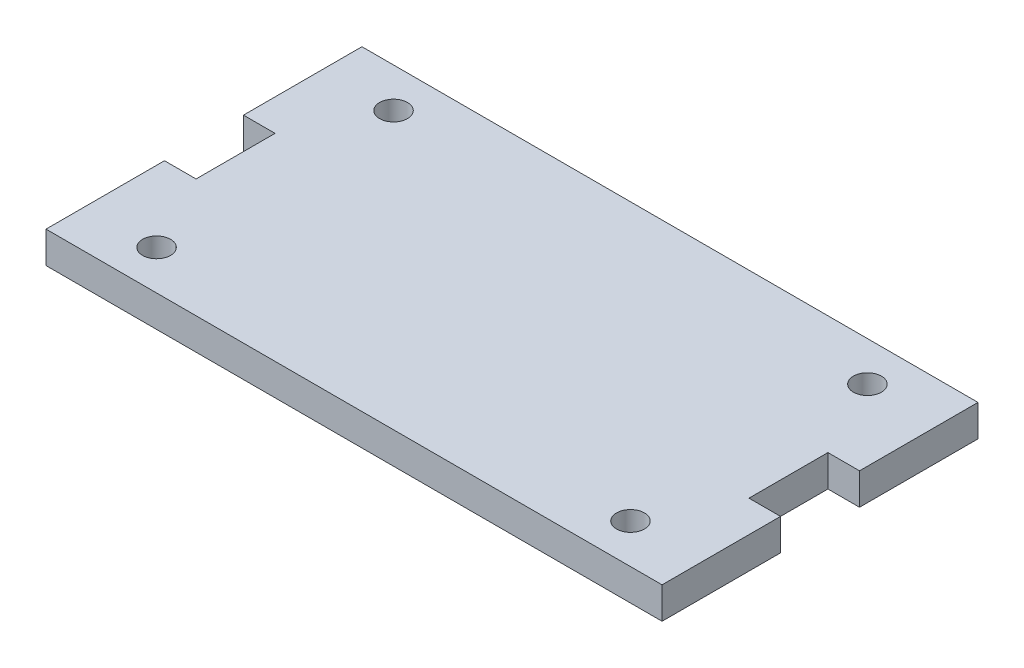
ISO-10303-21;
HEADER;
FILE_DESCRIPTION(('STEP AP214'),'2;1');
FILE_NAME('part.step','',(''),(''),'','','');
FILE_SCHEMA(('AUTOMOTIVE_DESIGN { 1 0 10303 214 1 1 1 1 }'));
ENDSEC;
DATA;
#1=APPLICATION_CONTEXT('core data for automotive mechanical design processes');
#2=APPLICATION_PROTOCOL_DEFINITION('international standard','automotive_design',2000,#1);
#3=PRODUCT_CONTEXT('',#1,'mechanical');
#4=PRODUCT('Part','Part','',(#3));
#5=PRODUCT_RELATED_PRODUCT_CATEGORY('part','',(#4));
#6=PRODUCT_DEFINITION_FORMATION('','',#4);
#7=PRODUCT_DEFINITION_CONTEXT('part definition',#1,'design');
#8=PRODUCT_DEFINITION('design','',#6,#7);
#9=PRODUCT_DEFINITION_SHAPE('','',#8);
#10=(LENGTH_UNIT() NAMED_UNIT(*) SI_UNIT(.MILLI.,.METRE.));
#11=(NAMED_UNIT(*) PLANE_ANGLE_UNIT() SI_UNIT($,.RADIAN.));
#12=(NAMED_UNIT(*) SI_UNIT($,.STERADIAN.) SOLID_ANGLE_UNIT());
#13=UNCERTAINTY_MEASURE_WITH_UNIT(LENGTH_MEASURE(1.E-05),#10,'distance_accuracy_value','');
#14=(GEOMETRIC_REPRESENTATION_CONTEXT(3) GLOBAL_UNCERTAINTY_ASSIGNED_CONTEXT((#13)) GLOBAL_UNIT_ASSIGNED_CONTEXT((#10,
#11,#12)) REPRESENTATION_CONTEXT('',''));
#15=CARTESIAN_POINT('',(0.,0.,0.));
#16=DIRECTION('',(0.,0.,1.));
#17=DIRECTION('',(1.,0.,0.));
#18=AXIS2_PLACEMENT_3D('',#15,#16,#17);
#19=CARTESIAN_POINT('',(44.45,5.08,0.));
#20=DIRECTION('',(1.,0.,0.));
#21=DIRECTION('',(0.,0.,-1.));
#22=AXIS2_PLACEMENT_3D('',#19,#20,#21);
#23=PLANE('',#22);
#24=DIRECTION('',(0.,0.,1.));
#25=VECTOR('',#24,1.);
#26=CARTESIAN_POINT('',(44.45,0.,0.));
#27=LINE('',#26,#25);
#28=CARTESIAN_POINT('',(44.45,0.,-6.35));
#29=VERTEX_POINT('',#28);
#30=CARTESIAN_POINT('',(44.45,0.,6.35));
#31=VERTEX_POINT('',#30);
#32=EDGE_CURVE('E152',#29,#31,#27,.T.);
#33=ORIENTED_EDGE('',*,*,#32,.F.);
#34=DIRECTION('',(0.,-1.,0.));
#35=VECTOR('',#34,1.);
#36=CARTESIAN_POINT('',(44.45,5.08,-6.35));
#37=LINE('',#36,#35);
#38=CARTESIAN_POINT('',(44.45,5.08,-6.35));
#39=VERTEX_POINT('',#38);
#40=EDGE_CURVE('E11',#39,#29,#37,.T.);
#41=ORIENTED_EDGE('',*,*,#40,.F.);
#42=DIRECTION('',(0.,0.,1.));
#43=VECTOR('',#42,1.);
#44=CARTESIAN_POINT('',(44.45,5.08,0.));
#45=LINE('',#44,#43);
#46=CARTESIAN_POINT('',(44.45,5.08,6.35));
#47=VERTEX_POINT('',#46);
#48=EDGE_CURVE('E184',#39,#47,#45,.T.);
#49=ORIENTED_EDGE('',*,*,#48,.T.);
#50=DIRECTION('',(0.,-1.,0.));
#51=VECTOR('',#50,1.);
#52=CARTESIAN_POINT('',(44.45,5.08,6.35));
#53=LINE('',#52,#51);
#54=EDGE_CURVE('E51',#47,#31,#53,.T.);
#55=ORIENTED_EDGE('',*,*,#54,.T.);
#56=EDGE_LOOP('',(#33,#41,#49,#55));
#57=FACE_BOUND('',#56,.T.);
#58=ADVANCED_FACE('F35',(#57),#23,.T.);
#59=CARTESIAN_POINT('',(0.,5.08,-6.35));
#60=DIRECTION('',(0.,0.,-1.));
#61=DIRECTION('',(-1.,0.,0.));
#62=AXIS2_PLACEMENT_3D('',#59,#60,#61);
#63=PLANE('',#62);
#64=DIRECTION('',(1.,0.,0.));
#65=VECTOR('',#64,1.);
#66=CARTESIAN_POINT('',(0.,0.,-6.35));
#67=LINE('',#66,#65);
#68=CARTESIAN_POINT('',(49.53,0.,-6.35));
#69=VERTEX_POINT('',#68);
#70=EDGE_CURVE('E154',#29,#69,#67,.T.);
#71=ORIENTED_EDGE('',*,*,#70,.T.);
#72=DIRECTION('',(0.,-1.,0.));
#73=VECTOR('',#72,1.);
#74=CARTESIAN_POINT('',(49.53,5.08,-6.35));
#75=LINE('',#74,#73);
#76=CARTESIAN_POINT('',(49.53,5.08,-6.35));
#77=VERTEX_POINT('',#76);
#78=EDGE_CURVE('E43',#77,#69,#75,.T.);
#79=ORIENTED_EDGE('',*,*,#78,.F.);
#80=DIRECTION('',(1.,0.,0.));
#81=VECTOR('',#80,1.);
#82=CARTESIAN_POINT('',(0.,5.08,-6.35));
#83=LINE('',#82,#81);
#84=EDGE_CURVE('E220',#39,#77,#83,.T.);
#85=ORIENTED_EDGE('',*,*,#84,.F.);
#86=ORIENTED_EDGE('',*,*,#40,.T.);
#87=EDGE_LOOP('',(#71,#79,#85,#86));
#88=FACE_BOUND('',#87,.T.);
#89=ADVANCED_FACE('F209',(#88),#63,.F.);
#90=CARTESIAN_POINT('',(49.53,5.08,0.));
#91=DIRECTION('',(1.,0.,0.));
#92=DIRECTION('',(0.,0.,-1.));
#93=AXIS2_PLACEMENT_3D('',#90,#91,#92);
#94=PLANE('',#93);
#95=DIRECTION('',(0.,0.,1.));
#96=VECTOR('',#95,1.);
#97=CARTESIAN_POINT('',(49.53,0.,0.));
#98=LINE('',#97,#96);
#99=CARTESIAN_POINT('',(49.53,0.,-25.4));
#100=VERTEX_POINT('',#99);
#101=EDGE_CURVE('E158',#100,#69,#98,.T.);
#102=ORIENTED_EDGE('',*,*,#101,.F.);
#103=DIRECTION('',(0.,-1.,0.));
#104=VECTOR('',#103,1.);
#105=CARTESIAN_POINT('',(49.53,5.08,-25.4));
#106=LINE('',#105,#104);
#107=CARTESIAN_POINT('',(49.53,5.08,-25.4));
#108=VERTEX_POINT('',#107);
#109=EDGE_CURVE('E199',#108,#100,#106,.T.);
#110=ORIENTED_EDGE('',*,*,#109,.F.);
#111=DIRECTION('',(0.,0.,1.));
#112=VECTOR('',#111,1.);
#113=CARTESIAN_POINT('',(49.53,5.08,0.));
#114=LINE('',#113,#112);
#115=EDGE_CURVE('E206',#108,#77,#114,.T.);
#116=ORIENTED_EDGE('',*,*,#115,.T.);
#117=ORIENTED_EDGE('',*,*,#78,.T.);
#118=EDGE_LOOP('',(#102,#110,#116,#117));
#119=FACE_BOUND('',#118,.T.);
#120=ADVANCED_FACE('F204',(#119),#94,.T.);
#121=CARTESIAN_POINT('',(0.,5.08,-25.4));
#122=DIRECTION('',(0.,0.,-1.));
#123=DIRECTION('',(-1.,0.,0.));
#124=AXIS2_PLACEMENT_3D('',#121,#122,#123);
#125=PLANE('',#124);
#126=DIRECTION('',(1.,0.,0.));
#127=VECTOR('',#126,1.);
#128=CARTESIAN_POINT('',(0.,0.,-25.4));
#129=LINE('',#128,#127);
#130=CARTESIAN_POINT('',(-49.53,0.,-25.4));
#131=VERTEX_POINT('',#130);
#132=EDGE_CURVE('E161',#131,#100,#129,.T.);
#133=ORIENTED_EDGE('',*,*,#132,.F.);
#134=DIRECTION('',(0.,-1.,0.));
#135=VECTOR('',#134,1.);
#136=CARTESIAN_POINT('',(-49.53,5.08,-25.4));
#137=LINE('',#136,#135);
#138=CARTESIAN_POINT('',(-49.53,5.08,-25.4));
#139=VERTEX_POINT('',#138);
#140=EDGE_CURVE('E197',#139,#131,#137,.T.);
#141=ORIENTED_EDGE('',*,*,#140,.F.);
#142=DIRECTION('',(1.,0.,0.));
#143=VECTOR('',#142,1.);
#144=CARTESIAN_POINT('',(0.,5.08,-25.4));
#145=LINE('',#144,#143);
#146=EDGE_CURVE('E219',#139,#108,#145,.T.);
#147=ORIENTED_EDGE('',*,*,#146,.T.);
#148=ORIENTED_EDGE('',*,*,#109,.T.);
#149=EDGE_LOOP('',(#133,#141,#147,#148));
#150=FACE_BOUND('',#149,.T.);
#151=ADVANCED_FACE('F215',(#150),#125,.T.);
#152=CARTESIAN_POINT('',(-49.53,5.08,0.));
#153=DIRECTION('',(1.,0.,0.));
#154=DIRECTION('',(0.,0.,-1.));
#155=AXIS2_PLACEMENT_3D('',#152,#153,#154);
#156=PLANE('',#155);
#157=DIRECTION('',(0.,0.,1.));
#158=VECTOR('',#157,1.);
#159=CARTESIAN_POINT('',(-49.53,0.,0.));
#160=LINE('',#159,#158);
#161=CARTESIAN_POINT('',(-49.53,0.,-6.35));
#162=VERTEX_POINT('',#161);
#163=EDGE_CURVE('E164',#131,#162,#160,.T.);
#164=ORIENTED_EDGE('',*,*,#163,.T.);
#165=DIRECTION('',(0.,-1.,0.));
#166=VECTOR('',#165,1.);
#167=CARTESIAN_POINT('',(-49.53,5.08,-6.35));
#168=LINE('',#167,#166);
#169=CARTESIAN_POINT('',(-49.53,5.08,-6.35));
#170=VERTEX_POINT('',#169);
#171=EDGE_CURVE('E195',#170,#162,#168,.T.);
#172=ORIENTED_EDGE('',*,*,#171,.F.);
#173=DIRECTION('',(0.,0.,1.));
#174=VECTOR('',#173,1.);
#175=CARTESIAN_POINT('',(-49.53,5.08,0.));
#176=LINE('',#175,#174);
#177=EDGE_CURVE('E222',#139,#170,#176,.T.);
#178=ORIENTED_EDGE('',*,*,#177,.F.);
#179=ORIENTED_EDGE('',*,*,#140,.T.);
#180=EDGE_LOOP('',(#164,#172,#178,#179));
#181=FACE_BOUND('',#180,.T.);
#182=ADVANCED_FACE('F262',(#181),#156,.F.);
#183=CARTESIAN_POINT('',(0.,5.08,-6.35000000000002));
#184=DIRECTION('',(0.,0.,1.));
#185=DIRECTION('',(1.,0.,0.));
#186=AXIS2_PLACEMENT_3D('',#183,#184,#185);
#187=PLANE('',#186);
#188=DIRECTION('',(-1.,0.,0.));
#189=VECTOR('',#188,1.);
#190=CARTESIAN_POINT('',(0.,0.,-6.35000000000002));
#191=LINE('',#190,#189);
#192=CARTESIAN_POINT('',(-44.45,0.,-6.35));
#193=VERTEX_POINT('',#192);
#194=EDGE_CURVE('E167',#193,#162,#191,.T.);
#195=ORIENTED_EDGE('',*,*,#194,.F.);
#196=DIRECTION('',(0.,-1.,0.));
#197=VECTOR('',#196,1.);
#198=CARTESIAN_POINT('',(-44.45,5.08,-6.35));
#199=LINE('',#198,#197);
#200=CARTESIAN_POINT('',(-44.45,5.08,-6.35));
#201=VERTEX_POINT('',#200);
#202=EDGE_CURVE('E193',#201,#193,#199,.T.);
#203=ORIENTED_EDGE('',*,*,#202,.F.);
#204=DIRECTION('',(-1.,0.,0.));
#205=VECTOR('',#204,1.);
#206=CARTESIAN_POINT('',(0.,5.08,-6.35000000000002));
#207=LINE('',#206,#205);
#208=EDGE_CURVE('E228',#201,#170,#207,.T.);
#209=ORIENTED_EDGE('',*,*,#208,.T.);
#210=ORIENTED_EDGE('',*,*,#171,.T.);
#211=EDGE_LOOP('',(#195,#203,#209,#210));
#212=FACE_BOUND('',#211,.T.);
#213=ADVANCED_FACE('F265',(#212),#187,.T.);
#214=CARTESIAN_POINT('',(-44.45,5.08,0.));
#215=DIRECTION('',(1.,0.,0.));
#216=DIRECTION('',(0.,0.,-1.));
#217=AXIS2_PLACEMENT_3D('',#214,#215,#216);
#218=PLANE('',#217);
#219=DIRECTION('',(0.,0.,1.));
#220=VECTOR('',#219,1.);
#221=CARTESIAN_POINT('',(-44.45,0.,0.));
#222=LINE('',#221,#220);
#223=CARTESIAN_POINT('',(-44.45,0.,6.35));
#224=VERTEX_POINT('',#223);
#225=EDGE_CURVE('E170',#193,#224,#222,.T.);
#226=ORIENTED_EDGE('',*,*,#225,.T.);
#227=DIRECTION('',(0.,-1.,0.));
#228=VECTOR('',#227,1.);
#229=CARTESIAN_POINT('',(-44.45,5.08,6.35));
#230=LINE('',#229,#228);
#231=CARTESIAN_POINT('',(-44.45,5.08,6.35));
#232=VERTEX_POINT('',#231);
#233=EDGE_CURVE('E190',#232,#224,#230,.T.);
#234=ORIENTED_EDGE('',*,*,#233,.F.);
#235=DIRECTION('',(0.,0.,1.));
#236=VECTOR('',#235,1.);
#237=CARTESIAN_POINT('',(-44.45,5.08,0.));
#238=LINE('',#237,#236);
#239=EDGE_CURVE('E231',#201,#232,#238,.T.);
#240=ORIENTED_EDGE('',*,*,#239,.F.);
#241=ORIENTED_EDGE('',*,*,#202,.T.);
#242=EDGE_LOOP('',(#226,#234,#240,#241));
#243=FACE_BOUND('',#242,.T.);
#244=ADVANCED_FACE('F269',(#243),#218,.F.);
#245=CARTESIAN_POINT('',(0.,5.08,6.35));
#246=DIRECTION('',(0.,0.,1.));
#247=DIRECTION('',(1.,0.,0.));
#248=AXIS2_PLACEMENT_3D('',#245,#246,#247);
#249=PLANE('',#248);
#250=DIRECTION('',(-1.,0.,0.));
#251=VECTOR('',#250,1.);
#252=CARTESIAN_POINT('',(0.,0.,6.35));
#253=LINE('',#252,#251);
#254=CARTESIAN_POINT('',(-49.53,0.,6.35));
#255=VERTEX_POINT('',#254);
#256=EDGE_CURVE('E172',#224,#255,#253,.T.);
#257=ORIENTED_EDGE('',*,*,#256,.T.);
#258=DIRECTION('',(0.,-1.,0.));
#259=VECTOR('',#258,1.);
#260=CARTESIAN_POINT('',(-49.53,5.08,6.35));
#261=LINE('',#260,#259);
#262=CARTESIAN_POINT('',(-49.53,5.08,6.35));
#263=VERTEX_POINT('',#262);
#264=EDGE_CURVE('E188',#263,#255,#261,.T.);
#265=ORIENTED_EDGE('',*,*,#264,.F.);
#266=DIRECTION('',(-1.,0.,0.));
#267=VECTOR('',#266,1.);
#268=CARTESIAN_POINT('',(0.,5.08,6.35));
#269=LINE('',#268,#267);
#270=EDGE_CURVE('E233',#232,#263,#269,.T.);
#271=ORIENTED_EDGE('',*,*,#270,.F.);
#272=ORIENTED_EDGE('',*,*,#233,.T.);
#273=EDGE_LOOP('',(#257,#265,#271,#272));
#274=FACE_BOUND('',#273,.T.);
#275=ADVANCED_FACE('F273',(#274),#249,.F.);
#276=CARTESIAN_POINT('',(-49.53,5.08,0.));
#277=DIRECTION('',(-1.,0.,0.));
#278=DIRECTION('',(0.,0.,1.));
#279=AXIS2_PLACEMENT_3D('',#276,#277,#278);
#280=PLANE('',#279);
#281=DIRECTION('',(0.,0.,-1.));
#282=VECTOR('',#281,1.);
#283=CARTESIAN_POINT('',(-49.53,0.,0.));
#284=LINE('',#283,#282);
#285=CARTESIAN_POINT('',(-49.53,0.,25.4));
#286=VERTEX_POINT('',#285);
#287=EDGE_CURVE('E175',#286,#255,#284,.T.);
#288=ORIENTED_EDGE('',*,*,#287,.F.);
#289=DIRECTION('',(0.,-1.,0.));
#290=VECTOR('',#289,1.);
#291=CARTESIAN_POINT('',(-49.53,5.08,25.4));
#292=LINE('',#291,#290);
#293=CARTESIAN_POINT('',(-49.53,5.08,25.4));
#294=VERTEX_POINT('',#293);
#295=EDGE_CURVE('E144',#294,#286,#292,.T.);
#296=ORIENTED_EDGE('',*,*,#295,.F.);
#297=DIRECTION('',(0.,0.,-1.));
#298=VECTOR('',#297,1.);
#299=CARTESIAN_POINT('',(-49.53,5.08,0.));
#300=LINE('',#299,#298);
#301=EDGE_CURVE('E134',#294,#263,#300,.T.);
#302=ORIENTED_EDGE('',*,*,#301,.T.);
#303=ORIENTED_EDGE('',*,*,#264,.T.);
#304=EDGE_LOOP('',(#288,#296,#302,#303));
#305=FACE_BOUND('',#304,.T.);
#306=ADVANCED_FACE('F236',(#305),#280,.T.);
#307=CARTESIAN_POINT('',(0.,5.08,25.4));
#308=DIRECTION('',(0.,0.,-1.));
#309=DIRECTION('',(-1.,0.,0.));
#310=AXIS2_PLACEMENT_3D('',#307,#308,#309);
#311=PLANE('',#310);
#312=DIRECTION('',(1.,0.,0.));
#313=VECTOR('',#312,1.);
#314=CARTESIAN_POINT('',(0.,0.,25.4));
#315=LINE('',#314,#313);
#316=CARTESIAN_POINT('',(49.53,0.,25.4));
#317=VERTEX_POINT('',#316);
#318=EDGE_CURVE('E141',#286,#317,#315,.T.);
#319=ORIENTED_EDGE('',*,*,#318,.T.);
#320=DIRECTION('',(0.,-1.,0.));
#321=VECTOR('',#320,1.);
#322=CARTESIAN_POINT('',(49.53,5.08,25.4));
#323=LINE('',#322,#321);
#324=CARTESIAN_POINT('',(49.53,5.08,25.4));
#325=VERTEX_POINT('',#324);
#326=EDGE_CURVE('E138',#325,#317,#323,.T.);
#327=ORIENTED_EDGE('',*,*,#326,.F.);
#328=DIRECTION('',(1.,0.,0.));
#329=VECTOR('',#328,1.);
#330=CARTESIAN_POINT('',(0.,5.08,25.4));
#331=LINE('',#330,#329);
#332=EDGE_CURVE('E126',#294,#325,#331,.T.);
#333=ORIENTED_EDGE('',*,*,#332,.F.);
#334=ORIENTED_EDGE('',*,*,#295,.T.);
#335=EDGE_LOOP('',(#319,#327,#333,#334));
#336=FACE_BOUND('',#335,.T.);
#337=ADVANCED_FACE('F139',(#336),#311,.F.);
#338=CARTESIAN_POINT('',(49.53,5.08,0.));
#339=DIRECTION('',(-1.,0.,0.));
#340=DIRECTION('',(0.,0.,1.));
#341=AXIS2_PLACEMENT_3D('',#338,#339,#340);
#342=PLANE('',#341);
#343=DIRECTION('',(0.,0.,-1.));
#344=VECTOR('',#343,1.);
#345=CARTESIAN_POINT('',(49.53,0.,0.));
#346=LINE('',#345,#344);
#347=CARTESIAN_POINT('',(49.53,0.,6.35));
#348=VERTEX_POINT('',#347);
#349=EDGE_CURVE('E179',#317,#348,#346,.T.);
#350=ORIENTED_EDGE('',*,*,#349,.T.);
#351=DIRECTION('',(0.,-1.,0.));
#352=VECTOR('',#351,1.);
#353=CARTESIAN_POINT('',(49.53,5.08,6.35));
#354=LINE('',#353,#352);
#355=CARTESIAN_POINT('',(49.53,5.08,6.35));
#356=VERTEX_POINT('',#355);
#357=EDGE_CURVE('E89',#356,#348,#354,.T.);
#358=ORIENTED_EDGE('',*,*,#357,.F.);
#359=DIRECTION('',(0.,0.,-1.));
#360=VECTOR('',#359,1.);
#361=CARTESIAN_POINT('',(49.53,5.08,0.));
#362=LINE('',#361,#360);
#363=EDGE_CURVE('E132',#325,#356,#362,.T.);
#364=ORIENTED_EDGE('',*,*,#363,.F.);
#365=ORIENTED_EDGE('',*,*,#326,.T.);
#366=EDGE_LOOP('',(#350,#358,#364,#365));
#367=FACE_BOUND('',#366,.T.);
#368=ADVANCED_FACE('F146',(#367),#342,.F.);
#369=CARTESIAN_POINT('',(0.,5.08,6.35));
#370=DIRECTION('',(0.,0.,-1.));
#371=DIRECTION('',(-1.,0.,0.));
#372=AXIS2_PLACEMENT_3D('',#369,#370,#371);
#373=PLANE('',#372);
#374=DIRECTION('',(1.,0.,0.));
#375=VECTOR('',#374,1.);
#376=CARTESIAN_POINT('',(0.,0.,6.35));
#377=LINE('',#376,#375);
#378=EDGE_CURVE('E181',#31,#348,#377,.T.);
#379=ORIENTED_EDGE('',*,*,#378,.F.);
#380=ORIENTED_EDGE('',*,*,#54,.F.);
#381=DIRECTION('',(1.,0.,0.));
#382=VECTOR('',#381,1.);
#383=CARTESIAN_POINT('',(0.,5.08,6.35));
#384=LINE('',#383,#382);
#385=EDGE_CURVE('E147',#47,#356,#384,.T.);
#386=ORIENTED_EDGE('',*,*,#385,.T.);
#387=ORIENTED_EDGE('',*,*,#357,.T.);
#388=EDGE_LOOP('',(#379,#380,#386,#387));
#389=FACE_BOUND('',#388,.T.);
#390=ADVANCED_FACE('F239',(#389),#373,.T.);
#391=CARTESIAN_POINT('',(0.,5.08,0.));
#392=DIRECTION('',(0.,1.,0.));
#393=DIRECTION('',(0.,0.,1.));
#394=AXIS2_PLACEMENT_3D('',#391,#392,#393);
#395=PLANE('',#394);
#396=CARTESIAN_POINT('',(-38.1,5.08,-19.05));
#397=DIRECTION('',(0.,1.,0.));
#398=DIRECTION('',(0.,0.,1.));
#399=AXIS2_PLACEMENT_3D('',#396,#397,#398);
#400=CIRCLE('',#399,2.2479);
#401=CARTESIAN_POINT('',(-38.1,5.08,-16.8021));
#402=VERTEX_POINT('',#401);
#403=EDGE_CURVE('E353',#402,#402,#400,.T.);
#404=ORIENTED_EDGE('',*,*,#403,.F.);
#405=EDGE_LOOP('',(#404));
#406=FACE_BOUND('',#405,.T.);
#407=CARTESIAN_POINT('',(38.1,5.08,19.05));
#408=DIRECTION('',(0.,1.,0.));
#409=DIRECTION('',(0.,0.,1.));
#410=AXIS2_PLACEMENT_3D('',#407,#408,#409);
#411=CIRCLE('',#410,2.2479);
#412=CARTESIAN_POINT('',(38.1,5.08,21.2979));
#413=VERTEX_POINT('',#412);
#414=EDGE_CURVE('E355',#413,#413,#411,.T.);
#415=ORIENTED_EDGE('',*,*,#414,.F.);
#416=EDGE_LOOP('',(#415));
#417=FACE_BOUND('',#416,.T.);
#418=CARTESIAN_POINT('',(38.1,5.08,-19.05));
#419=DIRECTION('',(0.,1.,0.));
#420=DIRECTION('',(0.,0.,1.));
#421=AXIS2_PLACEMENT_3D('',#418,#419,#420);
#422=CIRCLE('',#421,2.2479);
#423=CARTESIAN_POINT('',(38.1,5.08,-16.8021));
#424=VERTEX_POINT('',#423);
#425=EDGE_CURVE('E363',#424,#424,#422,.T.);
#426=ORIENTED_EDGE('',*,*,#425,.F.);
#427=EDGE_LOOP('',(#426));
#428=FACE_BOUND('',#427,.T.);
#429=CARTESIAN_POINT('',(-38.1,5.08,19.05));
#430=DIRECTION('',(0.,1.,0.));
#431=DIRECTION('',(0.,0.,1.));
#432=AXIS2_PLACEMENT_3D('',#429,#430,#431);
#433=CIRCLE('',#432,2.2479);
#434=CARTESIAN_POINT('',(-38.1,5.08,21.2979));
#435=VERTEX_POINT('',#434);
#436=EDGE_CURVE('E369',#435,#435,#433,.T.);
#437=ORIENTED_EDGE('',*,*,#436,.F.);
#438=EDGE_LOOP('',(#437));
#439=FACE_BOUND('',#438,.T.);
#440=ORIENTED_EDGE('',*,*,#48,.F.);
#441=ORIENTED_EDGE('',*,*,#84,.T.);
#442=ORIENTED_EDGE('',*,*,#115,.F.);
#443=ORIENTED_EDGE('',*,*,#146,.F.);
#444=ORIENTED_EDGE('',*,*,#177,.T.);
#445=ORIENTED_EDGE('',*,*,#208,.F.);
#446=ORIENTED_EDGE('',*,*,#239,.T.);
#447=ORIENTED_EDGE('',*,*,#270,.T.);
#448=ORIENTED_EDGE('',*,*,#301,.F.);
#449=ORIENTED_EDGE('',*,*,#332,.T.);
#450=ORIENTED_EDGE('',*,*,#363,.T.);
#451=ORIENTED_EDGE('',*,*,#385,.F.);
#452=EDGE_LOOP('',(#440,#441,#442,#443,#444,#445,#446,#447,#448,#449,#450,#451));
#453=FACE_BOUND('',#452,.T.);
#454=ADVANCED_FACE('F129',(#406,#417,#428,#439,#453),#395,.T.);
#455=CARTESIAN_POINT('',(0.,0.,0.));
#456=DIRECTION('',(0.,1.,0.));
#457=DIRECTION('',(0.,0.,1.));
#458=AXIS2_PLACEMENT_3D('',#455,#456,#457);
#459=PLANE('',#458);
#460=CARTESIAN_POINT('',(-38.1,0.,-19.05));
#461=DIRECTION('',(0.,1.,0.));
#462=DIRECTION('',(0.,0.,1.));
#463=AXIS2_PLACEMENT_3D('',#460,#461,#462);
#464=CIRCLE('',#463,2.2479);
#465=CARTESIAN_POINT('',(-38.1,0.,-16.8021));
#466=VERTEX_POINT('',#465);
#467=EDGE_CURVE('E350',#466,#466,#464,.T.);
#468=ORIENTED_EDGE('',*,*,#467,.T.);
#469=EDGE_LOOP('',(#468));
#470=FACE_BOUND('',#469,.T.);
#471=CARTESIAN_POINT('',(38.1,0.,19.05));
#472=DIRECTION('',(0.,1.,0.));
#473=DIRECTION('',(0.,0.,1.));
#474=AXIS2_PLACEMENT_3D('',#471,#472,#473);
#475=CIRCLE('',#474,2.2479);
#476=CARTESIAN_POINT('',(38.1,0.,21.2979));
#477=VERTEX_POINT('',#476);
#478=EDGE_CURVE('E360',#477,#477,#475,.T.);
#479=ORIENTED_EDGE('',*,*,#478,.T.);
#480=EDGE_LOOP('',(#479));
#481=FACE_BOUND('',#480,.T.);
#482=CARTESIAN_POINT('',(38.1,0.,-19.05));
#483=DIRECTION('',(0.,1.,0.));
#484=DIRECTION('',(0.,0.,1.));
#485=AXIS2_PLACEMENT_3D('',#482,#483,#484);
#486=CIRCLE('',#485,2.2479);
#487=CARTESIAN_POINT('',(38.1,0.,-16.8021));
#488=VERTEX_POINT('',#487);
#489=EDGE_CURVE('E366',#488,#488,#486,.T.);
#490=ORIENTED_EDGE('',*,*,#489,.T.);
#491=EDGE_LOOP('',(#490));
#492=FACE_BOUND('',#491,.T.);
#493=CARTESIAN_POINT('',(-38.1,0.,19.05));
#494=DIRECTION('',(0.,1.,0.));
#495=DIRECTION('',(0.,0.,1.));
#496=AXIS2_PLACEMENT_3D('',#493,#494,#495);
#497=CIRCLE('',#496,2.2479);
#498=CARTESIAN_POINT('',(-38.1,0.,21.2979));
#499=VERTEX_POINT('',#498);
#500=EDGE_CURVE('E155',#499,#499,#497,.T.);
#501=ORIENTED_EDGE('',*,*,#500,.T.);
#502=EDGE_LOOP('',(#501));
#503=FACE_BOUND('',#502,.T.);
#504=ORIENTED_EDGE('',*,*,#32,.T.);
#505=ORIENTED_EDGE('',*,*,#378,.T.);
#506=ORIENTED_EDGE('',*,*,#349,.F.);
#507=ORIENTED_EDGE('',*,*,#318,.F.);
#508=ORIENTED_EDGE('',*,*,#287,.T.);
#509=ORIENTED_EDGE('',*,*,#256,.F.);
#510=ORIENTED_EDGE('',*,*,#225,.F.);
#511=ORIENTED_EDGE('',*,*,#194,.T.);
#512=ORIENTED_EDGE('',*,*,#163,.F.);
#513=ORIENTED_EDGE('',*,*,#132,.T.);
#514=ORIENTED_EDGE('',*,*,#101,.T.);
#515=ORIENTED_EDGE('',*,*,#70,.F.);
#516=EDGE_LOOP('',(#504,#505,#506,#507,#508,#509,#510,#511,#512,#513,#514,#515));
#517=FACE_BOUND('',#516,.T.);
#518=ADVANCED_FACE('F211',(#470,#481,#492,#503,#517),#459,.F.);
#519=CARTESIAN_POINT('',(-38.1,5.08,19.05));
#520=DIRECTION('',(0.,1.,0.));
#521=DIRECTION('',(0.,0.,1.));
#522=AXIS2_PLACEMENT_3D('',#519,#520,#521);
#523=CYLINDRICAL_SURFACE('',#522,2.2479);
#524=ORIENTED_EDGE('',*,*,#500,.F.);
#525=EDGE_LOOP('',(#524));
#526=FACE_BOUND('',#525,.T.);
#527=ORIENTED_EDGE('',*,*,#436,.T.);
#528=EDGE_LOOP('',(#527));
#529=FACE_BOUND('',#528,.T.);
#530=ADVANCED_FACE('F305',(#526,#529),#523,.F.);
#531=CARTESIAN_POINT('',(38.1,5.08,-19.05));
#532=DIRECTION('',(0.,1.,0.));
#533=DIRECTION('',(0.,0.,1.));
#534=AXIS2_PLACEMENT_3D('',#531,#532,#533);
#535=CYLINDRICAL_SURFACE('',#534,2.2479);
#536=ORIENTED_EDGE('',*,*,#489,.F.);
#537=EDGE_LOOP('',(#536));
#538=FACE_BOUND('',#537,.T.);
#539=ORIENTED_EDGE('',*,*,#425,.T.);
#540=EDGE_LOOP('',(#539));
#541=FACE_BOUND('',#540,.T.);
#542=ADVANCED_FACE('F313',(#538,#541),#535,.F.);
#543=CARTESIAN_POINT('',(38.1,5.08,19.05));
#544=DIRECTION('',(0.,1.,0.));
#545=DIRECTION('',(0.,0.,1.));
#546=AXIS2_PLACEMENT_3D('',#543,#544,#545);
#547=CYLINDRICAL_SURFACE('',#546,2.2479);
#548=ORIENTED_EDGE('',*,*,#478,.F.);
#549=EDGE_LOOP('',(#548));
#550=FACE_BOUND('',#549,.T.);
#551=ORIENTED_EDGE('',*,*,#414,.T.);
#552=EDGE_LOOP('',(#551));
#553=FACE_BOUND('',#552,.T.);
#554=ADVANCED_FACE('F323',(#550,#553),#547,.F.);
#555=CARTESIAN_POINT('',(-38.1,5.08,-19.05));
#556=DIRECTION('',(0.,1.,0.));
#557=DIRECTION('',(0.,0.,1.));
#558=AXIS2_PLACEMENT_3D('',#555,#556,#557);
#559=CYLINDRICAL_SURFACE('',#558,2.2479);
#560=ORIENTED_EDGE('',*,*,#467,.F.);
#561=EDGE_LOOP('',(#560));
#562=FACE_BOUND('',#561,.T.);
#563=ORIENTED_EDGE('',*,*,#403,.T.);
#564=EDGE_LOOP('',(#563));
#565=FACE_BOUND('',#564,.T.);
#566=ADVANCED_FACE('F333',(#562,#565),#559,.F.);
#567=CLOSED_SHELL('',(#58,#89,#120,#151,#182,#213,#244,#275,#306,#337,#368,#390,#454,#518,#530,
#542,#554,#566));
#568=MANIFOLD_SOLID_BREP('B2',#567);
#569=ADVANCED_BREP_SHAPE_REPRESENTATION('',(#18,#568),#14);
#570=SHAPE_DEFINITION_REPRESENTATION(#9,#569);
ENDSEC;
END-ISO-10303-21;
